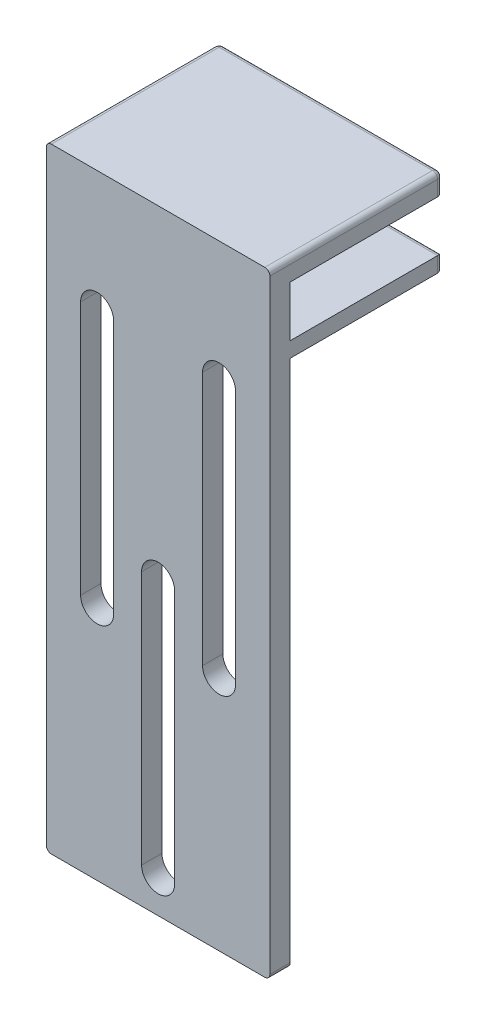
ISO-10303-21;
HEADER;
FILE_DESCRIPTION(('STEP AP214'),'2;1');
FILE_NAME('part.step','',(''),(''),'','','');
FILE_SCHEMA(('AUTOMOTIVE_DESIGN { 1 0 10303 214 1 1 1 1 }'));
ENDSEC;
DATA;
#1=APPLICATION_CONTEXT('core data for automotive mechanical design processes');
#2=APPLICATION_PROTOCOL_DEFINITION('international standard','automotive_design',2000,#1);
#3=PRODUCT_CONTEXT('',#1,'mechanical');
#4=PRODUCT('Part','Part','',(#3));
#5=PRODUCT_RELATED_PRODUCT_CATEGORY('part','',(#4));
#6=PRODUCT_DEFINITION_FORMATION('','',#4);
#7=PRODUCT_DEFINITION_CONTEXT('part definition',#1,'design');
#8=PRODUCT_DEFINITION('design','',#6,#7);
#9=PRODUCT_DEFINITION_SHAPE('','',#8);
#10=(LENGTH_UNIT() NAMED_UNIT(*) SI_UNIT(.MILLI.,.METRE.));
#11=(NAMED_UNIT(*) PLANE_ANGLE_UNIT() SI_UNIT($,.RADIAN.));
#12=(NAMED_UNIT(*) SI_UNIT($,.STERADIAN.) SOLID_ANGLE_UNIT());
#13=UNCERTAINTY_MEASURE_WITH_UNIT(LENGTH_MEASURE(1.E-05),#10,'distance_accuracy_value','');
#14=(GEOMETRIC_REPRESENTATION_CONTEXT(3) GLOBAL_UNCERTAINTY_ASSIGNED_CONTEXT((#13)) GLOBAL_UNIT_ASSIGNED_CONTEXT((#10,
#11,#12)) REPRESENTATION_CONTEXT('',''));
#15=CARTESIAN_POINT('',(0.,0.,0.));
#16=DIRECTION('',(0.,0.,1.));
#17=DIRECTION('',(1.,0.,0.));
#18=AXIS2_PLACEMENT_3D('',#15,#16,#17);
#19=CARTESIAN_POINT('',(0.,0.,0.));
#20=DIRECTION('',(0.,0.,1.));
#21=DIRECTION('',(1.,0.,0.));
#22=AXIS2_PLACEMENT_3D('',#19,#20,#21);
#23=PLANE('',#22);
#24=DIRECTION('',(0.,-1.,0.));
#25=VECTOR('',#24,1.);
#26=CARTESIAN_POINT('',(-22.,0.,0.));
#27=LINE('',#26,#25);
#28=CARTESIAN_POINT('',(-22.,117.,0.));
#29=VERTEX_POINT('',#28);
#30=CARTESIAN_POINT('',(-22.,107.,0.));
#31=VERTEX_POINT('',#30);
#32=EDGE_CURVE('E252',#29,#31,#27,.T.);
#33=ORIENTED_EDGE('',*,*,#32,.F.);
#34=DIRECTION('',(1.,0.,0.));
#35=VECTOR('',#34,1.);
#36=CARTESIAN_POINT('',(0.,117.,0.));
#37=LINE('',#36,#35);
#38=CARTESIAN_POINT('',(22.,117.,0.));
#39=VERTEX_POINT('',#38);
#40=EDGE_CURVE('E239',#29,#39,#37,.T.);
#41=ORIENTED_EDGE('',*,*,#40,.T.);
#42=DIRECTION('',(0.,1.,0.));
#43=VECTOR('',#42,1.);
#44=CARTESIAN_POINT('',(22.,0.,0.));
#45=LINE('',#44,#43);
#46=CARTESIAN_POINT('',(22.,107.,0.));
#47=VERTEX_POINT('',#46);
#48=EDGE_CURVE('E249',#47,#39,#45,.T.);
#49=ORIENTED_EDGE('',*,*,#48,.F.);
#50=DIRECTION('',(1.,0.,0.));
#51=VECTOR('',#50,1.);
#52=CARTESIAN_POINT('',(0.,107.,0.));
#53=LINE('',#52,#51);
#54=EDGE_CURVE('E445',#31,#47,#53,.T.);
#55=ORIENTED_EDGE('',*,*,#54,.F.);
#56=EDGE_LOOP('',(#33,#41,#49,#55));
#57=FACE_BOUND('',#56,.T.);
#58=ADVANCED_FACE('F39',(#57),#23,.F.);
#59=CARTESIAN_POINT('',(15.25,0.,4.));
#60=DIRECTION('',(1.,0.,0.));
#61=DIRECTION('',(0.,1.,0.));
#62=AXIS2_PLACEMENT_3D('',#59,#60,#61);
#63=PLANE('',#62);
#64=DIRECTION('',(0.,-1.,0.));
#65=VECTOR('',#64,1.);
#66=CARTESIAN_POINT('',(15.25,0.,0.));
#67=LINE('',#66,#65);
#68=CARTESIAN_POINT('',(15.25,97.,0.));
#69=VERTEX_POINT('',#68);
#70=CARTESIAN_POINT('',(15.25,47.,0.));
#71=VERTEX_POINT('',#70);
#72=EDGE_CURVE('E297',#69,#71,#67,.T.);
#73=ORIENTED_EDGE('',*,*,#72,.T.);
#74=DIRECTION('',(0.,0.,-1.));
#75=VECTOR('',#74,1.);
#76=CARTESIAN_POINT('',(15.25,47.,4.));
#77=LINE('',#76,#75);
#78=CARTESIAN_POINT('',(15.25,47.,4.));
#79=VERTEX_POINT('',#78);
#80=EDGE_CURVE('E317',#79,#71,#77,.T.);
#81=ORIENTED_EDGE('',*,*,#80,.F.);
#82=DIRECTION('',(0.,-1.,0.));
#83=VECTOR('',#82,1.);
#84=CARTESIAN_POINT('',(15.25,0.,4.));
#85=LINE('',#84,#83);
#86=CARTESIAN_POINT('',(15.25,97.,4.));
#87=VERTEX_POINT('',#86);
#88=EDGE_CURVE('E487',#87,#79,#85,.T.);
#89=ORIENTED_EDGE('',*,*,#88,.F.);
#90=DIRECTION('',(0.,0.,-1.));
#91=VECTOR('',#90,1.);
#92=CARTESIAN_POINT('',(15.25,97.,4.));
#93=LINE('',#92,#91);
#94=EDGE_CURVE('E309',#87,#69,#93,.T.);
#95=ORIENTED_EDGE('',*,*,#94,.T.);
#96=EDGE_LOOP('',(#73,#81,#89,#95));
#97=FACE_BOUND('',#96,.T.);
#98=ADVANCED_FACE('F506',(#97),#63,.F.);
#99=CARTESIAN_POINT('',(12.,47.,4.));
#100=DIRECTION('',(0.,0.,-1.));
#101=DIRECTION('',(-1.,0.,0.));
#102=AXIS2_PLACEMENT_3D('',#99,#100,#101);
#103=CYLINDRICAL_SURFACE('',#102,3.25);
#104=CARTESIAN_POINT('',(12.,47.,0.));
#105=DIRECTION('',(0.,0.,1.));
#106=DIRECTION('',(1.,0.,0.));
#107=AXIS2_PLACEMENT_3D('',#104,#105,#106);
#108=CIRCLE('',#107,3.25);
#109=CARTESIAN_POINT('',(8.75,47.,0.));
#110=VERTEX_POINT('',#109);
#111=EDGE_CURVE('E300',#71,#110,#108,.F.);
#112=ORIENTED_EDGE('',*,*,#111,.T.);
#113=DIRECTION('',(0.,0.,-1.));
#114=VECTOR('',#113,1.);
#115=CARTESIAN_POINT('',(8.75,47.,4.));
#116=LINE('',#115,#114);
#117=CARTESIAN_POINT('',(8.75,47.,4.));
#118=VERTEX_POINT('',#117);
#119=EDGE_CURVE('E315',#118,#110,#116,.T.);
#120=ORIENTED_EDGE('',*,*,#119,.F.);
#121=CARTESIAN_POINT('',(12.,47.,4.));
#122=DIRECTION('',(0.,0.,1.));
#123=DIRECTION('',(1.,0.,0.));
#124=AXIS2_PLACEMENT_3D('',#121,#122,#123);
#125=CIRCLE('',#124,3.25);
#126=EDGE_CURVE('E490',#79,#118,#125,.F.);
#127=ORIENTED_EDGE('',*,*,#126,.F.);
#128=ORIENTED_EDGE('',*,*,#80,.T.);
#129=EDGE_LOOP('',(#112,#120,#127,#128));
#130=FACE_BOUND('',#129,.T.);
#131=ADVANCED_FACE('F508',(#130),#103,.F.);
#132=CARTESIAN_POINT('',(8.75,0.,4.));
#133=DIRECTION('',(1.,0.,0.));
#134=DIRECTION('',(0.,0.,-1.));
#135=AXIS2_PLACEMENT_3D('',#132,#133,#134);
#136=PLANE('',#135);
#137=DIRECTION('',(0.,-1.,0.));
#138=VECTOR('',#137,1.);
#139=CARTESIAN_POINT('',(8.75,0.,0.));
#140=LINE('',#139,#138);
#141=CARTESIAN_POINT('',(8.75,97.,0.));
#142=VERTEX_POINT('',#141);
#143=EDGE_CURVE('E303',#142,#110,#140,.T.);
#144=ORIENTED_EDGE('',*,*,#143,.F.);
#145=DIRECTION('',(0.,0.,-1.));
#146=VECTOR('',#145,1.);
#147=CARTESIAN_POINT('',(8.75,97.,4.));
#148=LINE('',#147,#146);
#149=CARTESIAN_POINT('',(8.75,97.,4.));
#150=VERTEX_POINT('',#149);
#151=EDGE_CURVE('E312',#150,#142,#148,.T.);
#152=ORIENTED_EDGE('',*,*,#151,.F.);
#153=DIRECTION('',(0.,-1.,0.));
#154=VECTOR('',#153,1.);
#155=CARTESIAN_POINT('',(8.75,0.,4.));
#156=LINE('',#155,#154);
#157=EDGE_CURVE('E492',#150,#118,#156,.T.);
#158=ORIENTED_EDGE('',*,*,#157,.T.);
#159=ORIENTED_EDGE('',*,*,#119,.T.);
#160=EDGE_LOOP('',(#144,#152,#158,#159));
#161=FACE_BOUND('',#160,.T.);
#162=ADVANCED_FACE('F512',(#161),#136,.T.);
#163=CARTESIAN_POINT('',(0.,57.,4.));
#164=DIRECTION('',(0.,0.,-1.));
#165=DIRECTION('',(-1.,0.,0.));
#166=AXIS2_PLACEMENT_3D('',#163,#164,#165);
#167=CYLINDRICAL_SURFACE('',#166,3.25);
#168=CARTESIAN_POINT('',(0.,57.,0.));
#169=DIRECTION('',(0.,0.,1.));
#170=DIRECTION('',(1.,0.,0.));
#171=AXIS2_PLACEMENT_3D('',#168,#169,#170);
#172=CIRCLE('',#171,3.25);
#173=CARTESIAN_POINT('',(3.25,57.,0.));
#174=VERTEX_POINT('',#173);
#175=CARTESIAN_POINT('',(-3.25,57.,0.));
#176=VERTEX_POINT('',#175);
#177=EDGE_CURVE('E285',#174,#176,#172,.T.);
#178=ORIENTED_EDGE('',*,*,#177,.F.);
#179=DIRECTION('',(0.,0.,-1.));
#180=VECTOR('',#179,1.);
#181=CARTESIAN_POINT('',(3.25,57.,4.));
#182=LINE('',#181,#180);
#183=CARTESIAN_POINT('',(3.25,57.,4.));
#184=VERTEX_POINT('',#183);
#185=EDGE_CURVE('E313',#184,#174,#182,.T.);
#186=ORIENTED_EDGE('',*,*,#185,.F.);
#187=CARTESIAN_POINT('',(0.,57.,4.));
#188=DIRECTION('',(0.,0.,1.));
#189=DIRECTION('',(1.,0.,0.));
#190=AXIS2_PLACEMENT_3D('',#187,#188,#189);
#191=CIRCLE('',#190,3.25);
#192=CARTESIAN_POINT('',(-3.25,57.,4.));
#193=VERTEX_POINT('',#192);
#194=EDGE_CURVE('E476',#184,#193,#191,.T.);
#195=ORIENTED_EDGE('',*,*,#194,.T.);
#196=DIRECTION('',(0.,0.,-1.));
#197=VECTOR('',#196,1.);
#198=CARTESIAN_POINT('',(-3.25,57.,4.));
#199=LINE('',#198,#197);
#200=EDGE_CURVE('E321',#193,#176,#199,.T.);
#201=ORIENTED_EDGE('',*,*,#200,.T.);
#202=EDGE_LOOP('',(#178,#186,#195,#201));
#203=FACE_BOUND('',#202,.T.);
#204=ADVANCED_FACE('F555',(#203),#167,.F.);
#205=CARTESIAN_POINT('',(3.25,0.,4.));
#206=DIRECTION('',(-1.,0.,0.));
#207=DIRECTION('',(0.,0.,1.));
#208=AXIS2_PLACEMENT_3D('',#205,#206,#207);
#209=PLANE('',#208);
#210=DIRECTION('',(0.,1.,0.));
#211=VECTOR('',#210,1.);
#212=CARTESIAN_POINT('',(3.25,0.,0.));
#213=LINE('',#212,#211);
#214=CARTESIAN_POINT('',(3.25,7.,0.));
#215=VERTEX_POINT('',#214);
#216=EDGE_CURVE('E288',#215,#174,#213,.T.);
#217=ORIENTED_EDGE('',*,*,#216,.F.);
#218=DIRECTION('',(0.,0.,-1.));
#219=VECTOR('',#218,1.);
#220=CARTESIAN_POINT('',(3.25,7.,4.));
#221=LINE('',#220,#219);
#222=CARTESIAN_POINT('',(3.25,7.,4.));
#223=VERTEX_POINT('',#222);
#224=EDGE_CURVE('E326',#223,#215,#221,.T.);
#225=ORIENTED_EDGE('',*,*,#224,.F.);
#226=DIRECTION('',(0.,1.,0.));
#227=VECTOR('',#226,1.);
#228=CARTESIAN_POINT('',(3.25,0.,4.));
#229=LINE('',#228,#227);
#230=EDGE_CURVE('E479',#223,#184,#229,.T.);
#231=ORIENTED_EDGE('',*,*,#230,.T.);
#232=ORIENTED_EDGE('',*,*,#185,.T.);
#233=EDGE_LOOP('',(#217,#225,#231,#232));
#234=FACE_BOUND('',#233,.T.);
#235=ADVANCED_FACE('F551',(#234),#209,.T.);
#236=CARTESIAN_POINT('',(0.,7.,4.));
#237=DIRECTION('',(0.,0.,-1.));
#238=DIRECTION('',(-1.,0.,0.));
#239=AXIS2_PLACEMENT_3D('',#236,#237,#238);
#240=CYLINDRICAL_SURFACE('',#239,3.25);
#241=CARTESIAN_POINT('',(0.,7.,0.));
#242=DIRECTION('',(0.,0.,1.));
#243=DIRECTION('',(1.,0.,0.));
#244=AXIS2_PLACEMENT_3D('',#241,#242,#243);
#245=CIRCLE('',#244,3.25);
#246=CARTESIAN_POINT('',(-3.25,7.,0.));
#247=VERTEX_POINT('',#246);
#248=EDGE_CURVE('E291',#247,#215,#245,.T.);
#249=ORIENTED_EDGE('',*,*,#248,.F.);
#250=DIRECTION('',(0.,0.,-1.));
#251=VECTOR('',#250,1.);
#252=CARTESIAN_POINT('',(-3.25,7.,4.));
#253=LINE('',#252,#251);
#254=CARTESIAN_POINT('',(-3.25,7.,4.));
#255=VERTEX_POINT('',#254);
#256=EDGE_CURVE('E323',#255,#247,#253,.T.);
#257=ORIENTED_EDGE('',*,*,#256,.F.);
#258=CARTESIAN_POINT('',(0.,7.,4.));
#259=DIRECTION('',(0.,0.,1.));
#260=DIRECTION('',(1.,0.,0.));
#261=AXIS2_PLACEMENT_3D('',#258,#259,#260);
#262=CIRCLE('',#261,3.25);
#263=EDGE_CURVE('E482',#255,#223,#262,.T.);
#264=ORIENTED_EDGE('',*,*,#263,.T.);
#265=ORIENTED_EDGE('',*,*,#224,.T.);
#266=EDGE_LOOP('',(#249,#257,#264,#265));
#267=FACE_BOUND('',#266,.T.);
#268=ADVANCED_FACE('F547',(#267),#240,.F.);
#269=CARTESIAN_POINT('',(-12.,47.,4.));
#270=DIRECTION('',(0.,0.,-1.));
#271=DIRECTION('',(-1.,0.,0.));
#272=AXIS2_PLACEMENT_3D('',#269,#270,#271);
#273=CYLINDRICAL_SURFACE('',#272,3.25);
#274=CARTESIAN_POINT('',(-12.,47.,0.));
#275=DIRECTION('',(0.,0.,1.));
#276=DIRECTION('',(1.,0.,0.));
#277=AXIS2_PLACEMENT_3D('',#274,#275,#276);
#278=CIRCLE('',#277,3.25);
#279=CARTESIAN_POINT('',(-15.25,47.,0.));
#280=VERTEX_POINT('',#279);
#281=CARTESIAN_POINT('',(-8.75,47.,0.));
#282=VERTEX_POINT('',#281);
#283=EDGE_CURVE('E273',#280,#282,#278,.T.);
#284=ORIENTED_EDGE('',*,*,#283,.F.);
#285=DIRECTION('',(0.,0.,-1.));
#286=VECTOR('',#285,1.);
#287=CARTESIAN_POINT('',(-15.25,47.,4.));
#288=LINE('',#287,#286);
#289=CARTESIAN_POINT('',(-15.25,47.,4.));
#290=VERTEX_POINT('',#289);
#291=EDGE_CURVE('E324',#290,#280,#288,.T.);
#292=ORIENTED_EDGE('',*,*,#291,.F.);
#293=CARTESIAN_POINT('',(-12.,47.,4.));
#294=DIRECTION('',(0.,0.,1.));
#295=DIRECTION('',(1.,0.,0.));
#296=AXIS2_PLACEMENT_3D('',#293,#294,#295);
#297=CIRCLE('',#296,3.25);
#298=CARTESIAN_POINT('',(-8.75,47.,4.));
#299=VERTEX_POINT('',#298);
#300=EDGE_CURVE('E465',#290,#299,#297,.T.);
#301=ORIENTED_EDGE('',*,*,#300,.T.);
#302=DIRECTION('',(0.,0.,-1.));
#303=VECTOR('',#302,1.);
#304=CARTESIAN_POINT('',(-8.75,47.,4.));
#305=LINE('',#304,#303);
#306=EDGE_CURVE('E329',#299,#282,#305,.T.);
#307=ORIENTED_EDGE('',*,*,#306,.T.);
#308=EDGE_LOOP('',(#284,#292,#301,#307));
#309=FACE_BOUND('',#308,.T.);
#310=ADVANCED_FACE('F550',(#309),#273,.F.);
#311=CARTESIAN_POINT('',(-15.25,0.,4.));
#312=DIRECTION('',(1.,0.,0.));
#313=DIRECTION('',(0.,1.,0.));
#314=AXIS2_PLACEMENT_3D('',#311,#312,#313);
#315=PLANE('',#314);
#316=DIRECTION('',(0.,-1.,0.));
#317=VECTOR('',#316,1.);
#318=CARTESIAN_POINT('',(-15.25,0.,0.));
#319=LINE('',#318,#317);
#320=CARTESIAN_POINT('',(-15.25,97.,0.));
#321=VERTEX_POINT('',#320);
#322=EDGE_CURVE('E276',#321,#280,#319,.T.);
#323=ORIENTED_EDGE('',*,*,#322,.F.);
#324=DIRECTION('',(0.,0.,-1.));
#325=VECTOR('',#324,1.);
#326=CARTESIAN_POINT('',(-15.25,97.,4.));
#327=LINE('',#326,#325);
#328=CARTESIAN_POINT('',(-15.25,97.,4.));
#329=VERTEX_POINT('',#328);
#330=EDGE_CURVE('E334',#329,#321,#327,.T.);
#331=ORIENTED_EDGE('',*,*,#330,.F.);
#332=DIRECTION('',(0.,-1.,0.));
#333=VECTOR('',#332,1.);
#334=CARTESIAN_POINT('',(-15.25,0.,4.));
#335=LINE('',#334,#333);
#336=EDGE_CURVE('E468',#329,#290,#335,.T.);
#337=ORIENTED_EDGE('',*,*,#336,.T.);
#338=ORIENTED_EDGE('',*,*,#291,.T.);
#339=EDGE_LOOP('',(#323,#331,#337,#338));
#340=FACE_BOUND('',#339,.T.);
#341=ADVANCED_FACE('F568',(#340),#315,.T.);
#342=CARTESIAN_POINT('',(-12.,97.,4.));
#343=DIRECTION('',(0.,0.,-1.));
#344=DIRECTION('',(-1.,0.,0.));
#345=AXIS2_PLACEMENT_3D('',#342,#343,#344);
#346=CYLINDRICAL_SURFACE('',#345,3.25);
#347=CARTESIAN_POINT('',(-12.,97.,0.));
#348=DIRECTION('',(0.,0.,1.));
#349=DIRECTION('',(1.,0.,0.));
#350=AXIS2_PLACEMENT_3D('',#347,#348,#349);
#351=CIRCLE('',#350,3.25);
#352=CARTESIAN_POINT('',(-8.75,97.,0.));
#353=VERTEX_POINT('',#352);
#354=EDGE_CURVE('E279',#353,#321,#351,.T.);
#355=ORIENTED_EDGE('',*,*,#354,.F.);
#356=DIRECTION('',(0.,0.,-1.));
#357=VECTOR('',#356,1.);
#358=CARTESIAN_POINT('',(-8.75,97.,4.));
#359=LINE('',#358,#357);
#360=CARTESIAN_POINT('',(-8.75,97.,4.));
#361=VERTEX_POINT('',#360);
#362=EDGE_CURVE('E331',#361,#353,#359,.T.);
#363=ORIENTED_EDGE('',*,*,#362,.F.);
#364=CARTESIAN_POINT('',(-12.,97.,4.));
#365=DIRECTION('',(0.,0.,1.));
#366=DIRECTION('',(1.,0.,0.));
#367=AXIS2_PLACEMENT_3D('',#364,#365,#366);
#368=CIRCLE('',#367,3.25);
#369=EDGE_CURVE('E471',#361,#329,#368,.T.);
#370=ORIENTED_EDGE('',*,*,#369,.T.);
#371=ORIENTED_EDGE('',*,*,#330,.T.);
#372=EDGE_LOOP('',(#355,#363,#370,#371));
#373=FACE_BOUND('',#372,.T.);
#374=ADVANCED_FACE('F564',(#373),#346,.F.);
#375=CARTESIAN_POINT('',(21.,1.,4.));
#376=DIRECTION('',(0.,0.,-1.));
#377=DIRECTION('',(-1.,0.,0.));
#378=AXIS2_PLACEMENT_3D('',#375,#376,#377);
#379=CYLINDRICAL_SURFACE('',#378,1.);
#380=CARTESIAN_POINT('',(21.,1.,0.));
#381=DIRECTION('',(0.,0.,1.));
#382=DIRECTION('',(1.,0.,0.));
#383=AXIS2_PLACEMENT_3D('',#380,#381,#382);
#384=CIRCLE('',#383,1.);
#385=CARTESIAN_POINT('',(22.,1.00000000000001,0.));
#386=VERTEX_POINT('',#385);
#387=CARTESIAN_POINT('',(21.,0.,0.));
#388=VERTEX_POINT('',#387);
#389=EDGE_CURVE('E258',#386,#388,#384,.F.);
#390=ORIENTED_EDGE('',*,*,#389,.F.);
#391=DIRECTION('',(0.,0.,-1.));
#392=VECTOR('',#391,1.);
#393=CARTESIAN_POINT('',(22.,1.00000000000001,4.));
#394=LINE('',#393,#392);
#395=CARTESIAN_POINT('',(22.,1.00000000000001,4.));
#396=VERTEX_POINT('',#395);
#397=EDGE_CURVE('E332',#396,#386,#394,.T.);
#398=ORIENTED_EDGE('',*,*,#397,.F.);
#399=CARTESIAN_POINT('',(21.,1.,4.));
#400=DIRECTION('',(0.,0.,1.));
#401=DIRECTION('',(1.,0.,0.));
#402=AXIS2_PLACEMENT_3D('',#399,#400,#401);
#403=CIRCLE('',#402,1.);
#404=CARTESIAN_POINT('',(21.,0.,4.));
#405=VERTEX_POINT('',#404);
#406=EDGE_CURVE('E308',#396,#405,#403,.F.);
#407=ORIENTED_EDGE('',*,*,#406,.T.);
#408=DIRECTION('',(0.,0.,-1.));
#409=VECTOR('',#408,1.);
#410=CARTESIAN_POINT('',(21.,0.,4.));
#411=LINE('',#410,#409);
#412=EDGE_CURVE('E337',#405,#388,#411,.T.);
#413=ORIENTED_EDGE('',*,*,#412,.T.);
#414=EDGE_LOOP('',(#390,#398,#407,#413));
#415=FACE_BOUND('',#414,.T.);
#416=ADVANCED_FACE('F567',(#415),#379,.T.);
#417=CARTESIAN_POINT('',(22.,0.,4.));
#418=DIRECTION('',(-1.,0.,0.));
#419=DIRECTION('',(0.,-1.,0.));
#420=AXIS2_PLACEMENT_3D('',#417,#418,#419);
#421=PLANE('',#420);
#422=DIRECTION('',(0.,0.,1.));
#423=VECTOR('',#422,1.);
#424=CARTESIAN_POINT('',(22.,117.,-30.));
#425=LINE('',#424,#423);
#426=CARTESIAN_POINT('',(22.,117.,-29.));
#427=VERTEX_POINT('',#426);
#428=EDGE_CURVE('E236',#427,#39,#425,.T.);
#429=ORIENTED_EDGE('',*,*,#428,.F.);
#430=DIRECTION('',(0.,1.,0.));
#431=VECTOR('',#430,1.);
#432=CARTESIAN_POINT('',(22.,0.,-29.));
#433=LINE('',#432,#431);
#434=CARTESIAN_POINT('',(22.,120.,-29.));
#435=VERTEX_POINT('',#434);
#436=EDGE_CURVE('E11',#427,#435,#433,.T.);
#437=ORIENTED_EDGE('',*,*,#436,.T.);
#438=DIRECTION('',(0.,0.,-1.));
#439=VECTOR('',#438,1.);
#440=CARTESIAN_POINT('',(22.,120.,4.));
#441=LINE('',#440,#439);
#442=CARTESIAN_POINT('',(22.,120.,4.));
#443=VERTEX_POINT('',#442);
#444=EDGE_CURVE('E355',#443,#435,#441,.T.);
#445=ORIENTED_EDGE('',*,*,#444,.F.);
#446=DIRECTION('',(0.,1.,0.));
#447=VECTOR('',#446,1.);
#448=CARTESIAN_POINT('',(22.,0.,4.));
#449=LINE('',#448,#447);
#450=EDGE_CURVE('E451',#396,#443,#449,.T.);
#451=ORIENTED_EDGE('',*,*,#450,.F.);
#452=ORIENTED_EDGE('',*,*,#397,.T.);
#453=CARTESIAN_POINT('',(22.,104.,0.));
#454=VERTEX_POINT('',#453);
#455=EDGE_CURVE('E257',#386,#454,#45,.T.);
#456=ORIENTED_EDGE('',*,*,#455,.T.);
#457=DIRECTION('',(0.,0.,1.));
#458=VECTOR('',#457,1.);
#459=CARTESIAN_POINT('',(22.,104.,-30.));
#460=LINE('',#459,#458);
#461=CARTESIAN_POINT('',(22.,104.,-29.));
#462=VERTEX_POINT('',#461);
#463=EDGE_CURVE('E439',#462,#454,#460,.T.);
#464=ORIENTED_EDGE('',*,*,#463,.F.);
#465=DIRECTION('',(0.,1.,0.));
#466=VECTOR('',#465,1.);
#467=CARTESIAN_POINT('',(22.,0.,-29.));
#468=LINE('',#467,#466);
#469=CARTESIAN_POINT('',(22.,107.,-29.));
#470=VERTEX_POINT('',#469);
#471=EDGE_CURVE('E48',#462,#470,#468,.T.);
#472=ORIENTED_EDGE('',*,*,#471,.T.);
#473=DIRECTION('',(0.,0.,1.));
#474=VECTOR('',#473,1.);
#475=CARTESIAN_POINT('',(22.,107.,-30.));
#476=LINE('',#475,#474);
#477=EDGE_CURVE('E256',#470,#47,#476,.T.);
#478=ORIENTED_EDGE('',*,*,#477,.T.);
#479=ORIENTED_EDGE('',*,*,#48,.T.);
#480=EDGE_LOOP('',(#429,#437,#445,#451,#452,#456,#464,#472,#478,#479));
#481=FACE_BOUND('',#480,.T.);
#482=ADVANCED_FACE('F255',(#481),#421,.F.);
#483=CARTESIAN_POINT('',(21.,120.,4.));
#484=DIRECTION('',(0.,0.,-1.));
#485=DIRECTION('',(-1.,0.,0.));
#486=AXIS2_PLACEMENT_3D('',#483,#484,#485);
#487=CYLINDRICAL_SURFACE('',#486,1.);
#488=ORIENTED_EDGE('',*,*,#444,.T.);
#489=CARTESIAN_POINT('',(21.,120.,-29.));
#490=DIRECTION('',(0.,0.,-1.));
#491=DIRECTION('',(-1.,0.,0.));
#492=AXIS2_PLACEMENT_3D('',#489,#490,#491);
#493=CIRCLE('',#492,1.);
#494=CARTESIAN_POINT('',(21.,121.,-29.));
#495=VERTEX_POINT('',#494);
#496=EDGE_CURVE('E376',#435,#495,#493,.F.);
#497=ORIENTED_EDGE('',*,*,#496,.T.);
#498=DIRECTION('',(0.,0.,-1.));
#499=VECTOR('',#498,1.);
#500=CARTESIAN_POINT('',(21.,121.,4.));
#501=LINE('',#500,#499);
#502=CARTESIAN_POINT('',(21.,121.,4.));
#503=VERTEX_POINT('',#502);
#504=EDGE_CURVE('E352',#503,#495,#501,.T.);
#505=ORIENTED_EDGE('',*,*,#504,.F.);
#506=CARTESIAN_POINT('',(21.,120.,4.));
#507=DIRECTION('',(0.,0.,1.));
#508=DIRECTION('',(1.,0.,0.));
#509=AXIS2_PLACEMENT_3D('',#506,#507,#508);
#510=CIRCLE('',#509,1.);
#511=EDGE_CURVE('E453',#443,#503,#510,.T.);
#512=ORIENTED_EDGE('',*,*,#511,.F.);
#513=EDGE_LOOP('',(#488,#497,#505,#512));
#514=FACE_BOUND('',#513,.T.);
#515=ADVANCED_FACE('F593',(#514),#487,.T.);
#516=CARTESIAN_POINT('',(0.,121.,4.));
#517=DIRECTION('',(0.,-1.,0.));
#518=DIRECTION('',(0.,0.,-1.));
#519=AXIS2_PLACEMENT_3D('',#516,#517,#518);
#520=PLANE('',#519);
#521=ORIENTED_EDGE('',*,*,#504,.T.);
#522=DIRECTION('',(-1.,0.,0.));
#523=VECTOR('',#522,1.);
#524=CARTESIAN_POINT('',(0.,121.,-29.));
#525=LINE('',#524,#523);
#526=CARTESIAN_POINT('',(-21.,121.,-29.));
#527=VERTEX_POINT('',#526);
#528=EDGE_CURVE('E374',#495,#527,#525,.T.);
#529=ORIENTED_EDGE('',*,*,#528,.T.);
#530=DIRECTION('',(0.,0.,-1.));
#531=VECTOR('',#530,1.);
#532=CARTESIAN_POINT('',(-21.,121.,4.));
#533=LINE('',#532,#531);
#534=CARTESIAN_POINT('',(-21.,121.,4.));
#535=VERTEX_POINT('',#534);
#536=EDGE_CURVE('E349',#535,#527,#533,.T.);
#537=ORIENTED_EDGE('',*,*,#536,.F.);
#538=DIRECTION('',(-1.,0.,0.));
#539=VECTOR('',#538,1.);
#540=CARTESIAN_POINT('',(0.,121.,4.));
#541=LINE('',#540,#539);
#542=EDGE_CURVE('E455',#503,#535,#541,.T.);
#543=ORIENTED_EDGE('',*,*,#542,.F.);
#544=EDGE_LOOP('',(#521,#529,#537,#543));
#545=FACE_BOUND('',#544,.T.);
#546=ADVANCED_FACE('F589',(#545),#520,.F.);
#547=CARTESIAN_POINT('',(-21.,120.,4.));
#548=DIRECTION('',(0.,0.,-1.));
#549=DIRECTION('',(-1.,0.,0.));
#550=AXIS2_PLACEMENT_3D('',#547,#548,#549);
#551=CYLINDRICAL_SURFACE('',#550,1.);
#552=ORIENTED_EDGE('',*,*,#536,.T.);
#553=CARTESIAN_POINT('',(-21.,120.,-29.));
#554=DIRECTION('',(0.,0.,-1.));
#555=DIRECTION('',(-1.,0.,0.));
#556=AXIS2_PLACEMENT_3D('',#553,#554,#555);
#557=CIRCLE('',#556,1.);
#558=CARTESIAN_POINT('',(-22.,120.,-29.));
#559=VERTEX_POINT('',#558);
#560=EDGE_CURVE('E372',#527,#559,#557,.F.);
#561=ORIENTED_EDGE('',*,*,#560,.T.);
#562=DIRECTION('',(0.,0.,-1.));
#563=VECTOR('',#562,1.);
#564=CARTESIAN_POINT('',(-22.,120.,4.));
#565=LINE('',#564,#563);
#566=CARTESIAN_POINT('',(-22.,120.,4.));
#567=VERTEX_POINT('',#566);
#568=EDGE_CURVE('E346',#567,#559,#565,.T.);
#569=ORIENTED_EDGE('',*,*,#568,.F.);
#570=CARTESIAN_POINT('',(-21.,120.,4.));
#571=DIRECTION('',(0.,0.,1.));
#572=DIRECTION('',(1.,0.,0.));
#573=AXIS2_PLACEMENT_3D('',#570,#571,#572);
#574=CIRCLE('',#573,1.);
#575=EDGE_CURVE('E457',#535,#567,#574,.T.);
#576=ORIENTED_EDGE('',*,*,#575,.F.);
#577=EDGE_LOOP('',(#552,#561,#569,#576));
#578=FACE_BOUND('',#577,.T.);
#579=ADVANCED_FACE('F585',(#578),#551,.T.);
#580=CARTESIAN_POINT('',(-22.,0.,4.));
#581=DIRECTION('',(1.,0.,0.));
#582=DIRECTION('',(0.,1.,0.));
#583=AXIS2_PLACEMENT_3D('',#580,#581,#582);
#584=PLANE('',#583);
#585=ORIENTED_EDGE('',*,*,#568,.T.);
#586=DIRECTION('',(0.,-1.,0.));
#587=VECTOR('',#586,1.);
#588=CARTESIAN_POINT('',(-22.,0.,-29.));
#589=LINE('',#588,#587);
#590=CARTESIAN_POINT('',(-22.,117.,-29.));
#591=VERTEX_POINT('',#590);
#592=EDGE_CURVE('E360',#559,#591,#589,.T.);
#593=ORIENTED_EDGE('',*,*,#592,.T.);
#594=DIRECTION('',(0.,0.,1.));
#595=VECTOR('',#594,1.);
#596=CARTESIAN_POINT('',(-22.,117.,-30.));
#597=LINE('',#596,#595);
#598=EDGE_CURVE('E244',#591,#29,#597,.T.);
#599=ORIENTED_EDGE('',*,*,#598,.T.);
#600=ORIENTED_EDGE('',*,*,#32,.T.);
#601=DIRECTION('',(0.,0.,1.));
#602=VECTOR('',#601,1.);
#603=CARTESIAN_POINT('',(-22.,107.,-30.));
#604=LINE('',#603,#602);
#605=CARTESIAN_POINT('',(-22.,107.,-29.));
#606=VERTEX_POINT('',#605);
#607=EDGE_CURVE('E263',#606,#31,#604,.T.);
#608=ORIENTED_EDGE('',*,*,#607,.F.);
#609=DIRECTION('',(0.,-1.,0.));
#610=VECTOR('',#609,1.);
#611=CARTESIAN_POINT('',(-22.,0.,-29.));
#612=LINE('',#611,#610);
#613=CARTESIAN_POINT('',(-22.,104.,-29.));
#614=VERTEX_POINT('',#613);
#615=EDGE_CURVE('E320',#606,#614,#612,.T.);
#616=ORIENTED_EDGE('',*,*,#615,.T.);
#617=DIRECTION('',(0.,0.,1.));
#618=VECTOR('',#617,1.);
#619=CARTESIAN_POINT('',(-22.,104.,-30.));
#620=LINE('',#619,#618);
#621=CARTESIAN_POINT('',(-22.,104.,0.));
#622=VERTEX_POINT('',#621);
#623=EDGE_CURVE('E441',#614,#622,#620,.T.);
#624=ORIENTED_EDGE('',*,*,#623,.T.);
#625=CARTESIAN_POINT('',(-22.,1.00000000000001,0.));
#626=VERTEX_POINT('',#625);
#627=EDGE_CURVE('E261',#622,#626,#27,.T.);
#628=ORIENTED_EDGE('',*,*,#627,.T.);
#629=DIRECTION('',(0.,0.,-1.));
#630=VECTOR('',#629,1.);
#631=CARTESIAN_POINT('',(-22.,1.00000000000001,4.));
#632=LINE('',#631,#630);
#633=CARTESIAN_POINT('',(-22.,1.00000000000001,4.));
#634=VERTEX_POINT('',#633);
#635=EDGE_CURVE('E343',#634,#626,#632,.T.);
#636=ORIENTED_EDGE('',*,*,#635,.F.);
#637=DIRECTION('',(0.,-1.,0.));
#638=VECTOR('',#637,1.);
#639=CARTESIAN_POINT('',(-22.,0.,4.));
#640=LINE('',#639,#638);
#641=EDGE_CURVE('E459',#567,#634,#640,.T.);
#642=ORIENTED_EDGE('',*,*,#641,.F.);
#643=EDGE_LOOP('',(#585,#593,#599,#600,#608,#616,#624,#628,#636,#642));
#644=FACE_BOUND('',#643,.T.);
#645=ADVANCED_FACE('F581',(#644),#584,.F.);
#646=CARTESIAN_POINT('',(-21.,1.,4.));
#647=DIRECTION('',(0.,0.,-1.));
#648=DIRECTION('',(-1.,0.,0.));
#649=AXIS2_PLACEMENT_3D('',#646,#647,#648);
#650=CYLINDRICAL_SURFACE('',#649,1.);
#651=CARTESIAN_POINT('',(-21.,1.,0.));
#652=DIRECTION('',(0.,0.,1.));
#653=DIRECTION('',(1.,0.,0.));
#654=AXIS2_PLACEMENT_3D('',#651,#652,#653);
#655=CIRCLE('',#654,1.);
#656=CARTESIAN_POINT('',(-21.,0.,0.));
#657=VERTEX_POINT('',#656);
#658=EDGE_CURVE('E268',#626,#657,#655,.T.);
#659=ORIENTED_EDGE('',*,*,#658,.T.);
#660=DIRECTION('',(0.,0.,-1.));
#661=VECTOR('',#660,1.);
#662=CARTESIAN_POINT('',(-21.,0.,4.));
#663=LINE('',#662,#661);
#664=CARTESIAN_POINT('',(-21.,0.,4.));
#665=VERTEX_POINT('',#664);
#666=EDGE_CURVE('E339',#665,#657,#663,.T.);
#667=ORIENTED_EDGE('',*,*,#666,.F.);
#668=CARTESIAN_POINT('',(-21.,1.,4.));
#669=DIRECTION('',(0.,0.,1.));
#670=DIRECTION('',(1.,0.,0.));
#671=AXIS2_PLACEMENT_3D('',#668,#669,#670);
#672=CIRCLE('',#671,1.);
#673=EDGE_CURVE('E461',#634,#665,#672,.T.);
#674=ORIENTED_EDGE('',*,*,#673,.F.);
#675=ORIENTED_EDGE('',*,*,#635,.T.);
#676=EDGE_LOOP('',(#659,#667,#674,#675));
#677=FACE_BOUND('',#676,.T.);
#678=ADVANCED_FACE('F545',(#677),#650,.T.);
#679=CARTESIAN_POINT('',(-3.25,0.,4.));
#680=DIRECTION('',(-1.,0.,0.));
#681=DIRECTION('',(0.,0.,1.));
#682=AXIS2_PLACEMENT_3D('',#679,#680,#681);
#683=PLANE('',#682);
#684=DIRECTION('',(0.,1.,0.));
#685=VECTOR('',#684,1.);
#686=CARTESIAN_POINT('',(-3.25,0.,0.));
#687=LINE('',#686,#685);
#688=EDGE_CURVE('E294',#247,#176,#687,.T.);
#689=ORIENTED_EDGE('',*,*,#688,.T.);
#690=ORIENTED_EDGE('',*,*,#200,.F.);
#691=DIRECTION('',(0.,1.,0.));
#692=VECTOR('',#691,1.);
#693=CARTESIAN_POINT('',(-3.25,0.,4.));
#694=LINE('',#693,#692);
#695=EDGE_CURVE('E485',#255,#193,#694,.T.);
#696=ORIENTED_EDGE('',*,*,#695,.F.);
#697=ORIENTED_EDGE('',*,*,#256,.T.);
#698=EDGE_LOOP('',(#689,#690,#696,#697));
#699=FACE_BOUND('',#698,.T.);
#700=ADVANCED_FACE('F541',(#699),#683,.F.);
#701=CARTESIAN_POINT('',(-8.75,0.,4.));
#702=DIRECTION('',(1.,0.,0.));
#703=DIRECTION('',(0.,0.,-1.));
#704=AXIS2_PLACEMENT_3D('',#701,#702,#703);
#705=PLANE('',#704);
#706=DIRECTION('',(0.,-1.,0.));
#707=VECTOR('',#706,1.);
#708=CARTESIAN_POINT('',(-8.75,0.,0.));
#709=LINE('',#708,#707);
#710=EDGE_CURVE('E282',#353,#282,#709,.T.);
#711=ORIENTED_EDGE('',*,*,#710,.T.);
#712=ORIENTED_EDGE('',*,*,#306,.F.);
#713=DIRECTION('',(0.,-1.,0.));
#714=VECTOR('',#713,1.);
#715=CARTESIAN_POINT('',(-8.75,0.,4.));
#716=LINE('',#715,#714);
#717=EDGE_CURVE('E474',#361,#299,#716,.T.);
#718=ORIENTED_EDGE('',*,*,#717,.F.);
#719=ORIENTED_EDGE('',*,*,#362,.T.);
#720=EDGE_LOOP('',(#711,#712,#718,#719));
#721=FACE_BOUND('',#720,.T.);
#722=ADVANCED_FACE('F544',(#721),#705,.F.);
#723=CARTESIAN_POINT('',(0.,0.,4.));
#724=DIRECTION('',(0.,1.,0.));
#725=DIRECTION('',(0.,0.,1.));
#726=AXIS2_PLACEMENT_3D('',#723,#724,#725);
#727=PLANE('',#726);
#728=DIRECTION('',(1.,0.,0.));
#729=VECTOR('',#728,1.);
#730=CARTESIAN_POINT('',(0.,0.,0.));
#731=LINE('',#730,#729);
#732=EDGE_CURVE('E270',#657,#388,#731,.T.);
#733=ORIENTED_EDGE('',*,*,#732,.T.);
#734=ORIENTED_EDGE('',*,*,#412,.F.);
#735=DIRECTION('',(1.,0.,0.));
#736=VECTOR('',#735,1.);
#737=CARTESIAN_POINT('',(0.,0.,4.));
#738=LINE('',#737,#736);
#739=EDGE_CURVE('E463',#665,#405,#738,.T.);
#740=ORIENTED_EDGE('',*,*,#739,.F.);
#741=ORIENTED_EDGE('',*,*,#666,.T.);
#742=EDGE_LOOP('',(#733,#734,#740,#741));
#743=FACE_BOUND('',#742,.T.);
#744=ADVANCED_FACE('F562',(#743),#727,.F.);
#745=CARTESIAN_POINT('',(12.,97.,4.));
#746=DIRECTION('',(0.,0.,-1.));
#747=DIRECTION('',(-1.,0.,0.));
#748=AXIS2_PLACEMENT_3D('',#745,#746,#747);
#749=CYLINDRICAL_SURFACE('',#748,3.25);
#750=CARTESIAN_POINT('',(12.,97.,0.));
#751=DIRECTION('',(0.,0.,1.));
#752=DIRECTION('',(1.,0.,0.));
#753=AXIS2_PLACEMENT_3D('',#750,#751,#752);
#754=CIRCLE('',#753,3.25);
#755=EDGE_CURVE('E306',#142,#69,#754,.F.);
#756=ORIENTED_EDGE('',*,*,#755,.T.);
#757=ORIENTED_EDGE('',*,*,#94,.F.);
#758=CARTESIAN_POINT('',(12.,97.,4.));
#759=DIRECTION('',(0.,0.,1.));
#760=DIRECTION('',(1.,0.,0.));
#761=AXIS2_PLACEMENT_3D('',#758,#759,#760);
#762=CIRCLE('',#761,3.25);
#763=EDGE_CURVE('E340',#150,#87,#762,.F.);
#764=ORIENTED_EDGE('',*,*,#763,.F.);
#765=ORIENTED_EDGE('',*,*,#151,.T.);
#766=EDGE_LOOP('',(#756,#757,#764,#765));
#767=FACE_BOUND('',#766,.T.);
#768=ADVANCED_FACE('F502',(#767),#749,.F.);
#769=CARTESIAN_POINT('',(0.,0.,4.));
#770=DIRECTION('',(0.,0.,1.));
#771=DIRECTION('',(1.,0.,0.));
#772=AXIS2_PLACEMENT_3D('',#769,#770,#771);
#773=PLANE('',#772);
#774=ORIENTED_EDGE('',*,*,#406,.F.);
#775=ORIENTED_EDGE('',*,*,#450,.T.);
#776=ORIENTED_EDGE('',*,*,#511,.T.);
#777=ORIENTED_EDGE('',*,*,#542,.T.);
#778=ORIENTED_EDGE('',*,*,#575,.T.);
#779=ORIENTED_EDGE('',*,*,#641,.T.);
#780=ORIENTED_EDGE('',*,*,#673,.T.);
#781=ORIENTED_EDGE('',*,*,#739,.T.);
#782=EDGE_LOOP('',(#774,#775,#776,#777,#778,#779,#780,#781));
#783=FACE_BOUND('',#782,.T.);
#784=ORIENTED_EDGE('',*,*,#300,.F.);
#785=ORIENTED_EDGE('',*,*,#336,.F.);
#786=ORIENTED_EDGE('',*,*,#369,.F.);
#787=ORIENTED_EDGE('',*,*,#717,.T.);
#788=EDGE_LOOP('',(#784,#785,#786,#787));
#789=FACE_BOUND('',#788,.T.);
#790=ORIENTED_EDGE('',*,*,#194,.F.);
#791=ORIENTED_EDGE('',*,*,#230,.F.);
#792=ORIENTED_EDGE('',*,*,#263,.F.);
#793=ORIENTED_EDGE('',*,*,#695,.T.);
#794=EDGE_LOOP('',(#790,#791,#792,#793));
#795=FACE_BOUND('',#794,.T.);
#796=ORIENTED_EDGE('',*,*,#88,.T.);
#797=ORIENTED_EDGE('',*,*,#126,.T.);
#798=ORIENTED_EDGE('',*,*,#157,.F.);
#799=ORIENTED_EDGE('',*,*,#763,.T.);
#800=EDGE_LOOP('',(#796,#797,#798,#799));
#801=FACE_BOUND('',#800,.T.);
#802=ADVANCED_FACE('F498',(#783,#789,#795,#801),#773,.T.);
#803=ORIENTED_EDGE('',*,*,#627,.F.);
#804=DIRECTION('',(1.,0.,0.));
#805=VECTOR('',#804,1.);
#806=CARTESIAN_POINT('',(0.,104.,0.));
#807=LINE('',#806,#805);
#808=EDGE_CURVE('E243',#622,#454,#807,.T.);
#809=ORIENTED_EDGE('',*,*,#808,.T.);
#810=ORIENTED_EDGE('',*,*,#455,.F.);
#811=ORIENTED_EDGE('',*,*,#389,.T.);
#812=ORIENTED_EDGE('',*,*,#732,.F.);
#813=ORIENTED_EDGE('',*,*,#658,.F.);
#814=EDGE_LOOP('',(#803,#809,#810,#811,#812,#813));
#815=FACE_BOUND('',#814,.T.);
#816=ORIENTED_EDGE('',*,*,#283,.T.);
#817=ORIENTED_EDGE('',*,*,#710,.F.);
#818=ORIENTED_EDGE('',*,*,#354,.T.);
#819=ORIENTED_EDGE('',*,*,#322,.T.);
#820=EDGE_LOOP('',(#816,#817,#818,#819));
#821=FACE_BOUND('',#820,.T.);
#822=ORIENTED_EDGE('',*,*,#177,.T.);
#823=ORIENTED_EDGE('',*,*,#688,.F.);
#824=ORIENTED_EDGE('',*,*,#248,.T.);
#825=ORIENTED_EDGE('',*,*,#216,.T.);
#826=EDGE_LOOP('',(#822,#823,#824,#825));
#827=FACE_BOUND('',#826,.T.);
#828=ORIENTED_EDGE('',*,*,#72,.F.);
#829=ORIENTED_EDGE('',*,*,#755,.F.);
#830=ORIENTED_EDGE('',*,*,#143,.T.);
#831=ORIENTED_EDGE('',*,*,#111,.F.);
#832=EDGE_LOOP('',(#828,#829,#830,#831));
#833=FACE_BOUND('',#832,.T.);
#834=ADVANCED_FACE('F514',(#815,#821,#827,#833),#23,.F.);
#835=CARTESIAN_POINT('',(0.,107.,-30.));
#836=DIRECTION('',(0.,-1.,0.));
#837=DIRECTION('',(0.,0.,-1.));
#838=AXIS2_PLACEMENT_3D('',#835,#836,#837);
#839=PLANE('',#838);
#840=ORIENTED_EDGE('',*,*,#477,.F.);
#841=DIRECTION('',(1.,0.,0.));
#842=VECTOR('',#841,1.);
#843=CARTESIAN_POINT('',(0.,107.,-29.));
#844=LINE('',#843,#842);
#845=EDGE_CURVE('E390',#470,#606,#844,.F.);
#846=ORIENTED_EDGE('',*,*,#845,.T.);
#847=ORIENTED_EDGE('',*,*,#607,.T.);
#848=ORIENTED_EDGE('',*,*,#54,.T.);
#849=EDGE_LOOP('',(#840,#846,#847,#848));
#850=FACE_BOUND('',#849,.T.);
#851=ADVANCED_FACE('F516',(#850),#839,.F.);
#852=CARTESIAN_POINT('',(0.,104.,-30.));
#853=DIRECTION('',(0.,-1.,0.));
#854=DIRECTION('',(0.,0.,-1.));
#855=AXIS2_PLACEMENT_3D('',#852,#853,#854);
#856=PLANE('',#855);
#857=ORIENTED_EDGE('',*,*,#623,.F.);
#858=DIRECTION('',(1.,0.,0.));
#859=VECTOR('',#858,1.);
#860=CARTESIAN_POINT('',(22.,104.,-29.));
#861=LINE('',#860,#859);
#862=EDGE_CURVE('E378',#614,#462,#861,.T.);
#863=ORIENTED_EDGE('',*,*,#862,.T.);
#864=ORIENTED_EDGE('',*,*,#463,.T.);
#865=ORIENTED_EDGE('',*,*,#808,.F.);
#866=EDGE_LOOP('',(#857,#863,#864,#865));
#867=FACE_BOUND('',#866,.T.);
#868=ADVANCED_FACE('F437',(#867),#856,.T.);
#869=CARTESIAN_POINT('',(0.,0.,-30.));
#870=DIRECTION('',(0.,0.,1.));
#871=DIRECTION('',(1.,0.,0.));
#872=AXIS2_PLACEMENT_3D('',#869,#870,#871);
#873=PLANE('',#872);
#874=DIRECTION('',(1.,0.,0.));
#875=VECTOR('',#874,1.);
#876=CARTESIAN_POINT('',(-22.,105.,-30.));
#877=LINE('',#876,#875);
#878=CARTESIAN_POINT('',(21.,105.,-30.));
#879=VERTEX_POINT('',#878);
#880=CARTESIAN_POINT('',(-21.,105.,-30.));
#881=VERTEX_POINT('',#880);
#882=EDGE_CURVE('E385',#879,#881,#877,.F.);
#883=ORIENTED_EDGE('',*,*,#882,.T.);
#884=DIRECTION('',(0.,-1.,0.));
#885=VECTOR('',#884,1.);
#886=CARTESIAN_POINT('',(-21.,0.,-30.));
#887=LINE('',#886,#885);
#888=CARTESIAN_POINT('',(-21.,106.,-30.));
#889=VERTEX_POINT('',#888);
#890=EDGE_CURVE('E388',#881,#889,#887,.F.);
#891=ORIENTED_EDGE('',*,*,#890,.T.);
#892=DIRECTION('',(1.,0.,0.));
#893=VECTOR('',#892,1.);
#894=CARTESIAN_POINT('',(0.,106.,-30.));
#895=LINE('',#894,#893);
#896=CARTESIAN_POINT('',(21.,106.,-30.));
#897=VERTEX_POINT('',#896);
#898=EDGE_CURVE('E383',#889,#897,#895,.T.);
#899=ORIENTED_EDGE('',*,*,#898,.T.);
#900=DIRECTION('',(0.,1.,0.));
#901=VECTOR('',#900,1.);
#902=CARTESIAN_POINT('',(21.,0.,-30.));
#903=LINE('',#902,#901);
#904=EDGE_CURVE('E381',#897,#879,#903,.F.);
#905=ORIENTED_EDGE('',*,*,#904,.T.);
#906=EDGE_LOOP('',(#883,#891,#899,#905));
#907=FACE_BOUND('',#906,.T.);
#908=ADVANCED_FACE('F428',(#907),#873,.F.);
#909=CARTESIAN_POINT('',(0.,117.,-30.));
#910=DIRECTION('',(0.,-1.,0.));
#911=DIRECTION('',(0.,0.,-1.));
#912=AXIS2_PLACEMENT_3D('',#909,#910,#911);
#913=PLANE('',#912);
#914=ORIENTED_EDGE('',*,*,#598,.F.);
#915=DIRECTION('',(1.,0.,0.));
#916=VECTOR('',#915,1.);
#917=CARTESIAN_POINT('',(22.,117.,-29.));
#918=LINE('',#917,#916);
#919=EDGE_CURVE('E56',#591,#427,#918,.T.);
#920=ORIENTED_EDGE('',*,*,#919,.T.);
#921=ORIENTED_EDGE('',*,*,#428,.T.);
#922=ORIENTED_EDGE('',*,*,#40,.F.);
#923=EDGE_LOOP('',(#914,#920,#921,#922));
#924=FACE_BOUND('',#923,.T.);
#925=ADVANCED_FACE('F238',(#924),#913,.T.);
#926=CARTESIAN_POINT('',(0.,0.,-30.));
#927=DIRECTION('',(0.,0.,1.));
#928=DIRECTION('',(1.,0.,0.));
#929=AXIS2_PLACEMENT_3D('',#926,#927,#928);
#930=PLANE('',#929);
#931=DIRECTION('',(1.,0.,0.));
#932=VECTOR('',#931,1.);
#933=CARTESIAN_POINT('',(-22.,118.,-30.));
#934=LINE('',#933,#932);
#935=CARTESIAN_POINT('',(21.,118.,-30.));
#936=VERTEX_POINT('',#935);
#937=CARTESIAN_POINT('',(-21.,118.,-30.));
#938=VERTEX_POINT('',#937);
#939=EDGE_CURVE('E365',#936,#938,#934,.F.);
#940=ORIENTED_EDGE('',*,*,#939,.T.);
#941=DIRECTION('',(0.,-1.,0.));
#942=VECTOR('',#941,1.);
#943=CARTESIAN_POINT('',(-21.,0.,-30.));
#944=LINE('',#943,#942);
#945=CARTESIAN_POINT('',(-21.,120.,-30.));
#946=VERTEX_POINT('',#945);
#947=EDGE_CURVE('E369',#938,#946,#944,.F.);
#948=ORIENTED_EDGE('',*,*,#947,.T.);
#949=DIRECTION('',(-1.,0.,0.));
#950=VECTOR('',#949,1.);
#951=CARTESIAN_POINT('',(0.,120.,-30.));
#952=LINE('',#951,#950);
#953=CARTESIAN_POINT('',(21.,120.,-30.));
#954=VERTEX_POINT('',#953);
#955=EDGE_CURVE('E367',#946,#954,#952,.F.);
#956=ORIENTED_EDGE('',*,*,#955,.T.);
#957=DIRECTION('',(0.,1.,0.));
#958=VECTOR('',#957,1.);
#959=CARTESIAN_POINT('',(21.,0.,-30.));
#960=LINE('',#959,#958);
#961=EDGE_CURVE('E363',#954,#936,#960,.F.);
#962=ORIENTED_EDGE('',*,*,#961,.T.);
#963=EDGE_LOOP('',(#940,#948,#956,#962));
#964=FACE_BOUND('',#963,.T.);
#965=ADVANCED_FACE('F626',(#964),#930,.F.);
#966=CARTESIAN_POINT('',(21.,120.,-29.));
#967=DIRECTION('',(0.,0.,1.));
#968=DIRECTION('',(1.,0.,0.));
#969=AXIS2_PLACEMENT_3D('',#966,#967,#968);
#970=SPHERICAL_SURFACE('',#969,1.);
#971=CARTESIAN_POINT('',(21.,120.,-29.));
#972=DIRECTION('',(0.,-1.,0.));
#973=DIRECTION('',(0.,0.,-1.));
#974=AXIS2_PLACEMENT_3D('',#971,#972,#973);
#975=CIRCLE('',#974,1.);
#976=EDGE_CURVE('E404',#954,#435,#975,.T.);
#977=ORIENTED_EDGE('',*,*,#976,.F.);
#978=CARTESIAN_POINT('',(21.,120.,-29.));
#979=DIRECTION('',(-1.,0.,0.));
#980=DIRECTION('',(0.,-1.,0.));
#981=AXIS2_PLACEMENT_3D('',#978,#979,#980);
#982=CIRCLE('',#981,1.);
#983=EDGE_CURVE('E253',#495,#954,#982,.T.);
#984=ORIENTED_EDGE('',*,*,#983,.F.);
#985=ORIENTED_EDGE('',*,*,#496,.F.);
#986=EDGE_LOOP('',(#977,#984,#985));
#987=FACE_BOUND('',#986,.T.);
#988=ADVANCED_FACE('F622',(#987),#970,.T.);
#989=CARTESIAN_POINT('',(0.,120.,-29.));
#990=DIRECTION('',(-1.,0.,0.));
#991=DIRECTION('',(0.,0.,1.));
#992=AXIS2_PLACEMENT_3D('',#989,#990,#991);
#993=CYLINDRICAL_SURFACE('',#992,1.);
#994=ORIENTED_EDGE('',*,*,#983,.T.);
#995=ORIENTED_EDGE('',*,*,#955,.F.);
#996=CARTESIAN_POINT('',(-21.,120.,-29.));
#997=DIRECTION('',(-1.,0.,0.));
#998=DIRECTION('',(0.,0.,1.));
#999=AXIS2_PLACEMENT_3D('',#996,#997,#998);
#1000=CIRCLE('',#999,1.);
#1001=EDGE_CURVE('E401',#527,#946,#1000,.T.);
#1002=ORIENTED_EDGE('',*,*,#1001,.F.);
#1003=ORIENTED_EDGE('',*,*,#528,.F.);
#1004=EDGE_LOOP('',(#994,#995,#1002,#1003));
#1005=FACE_BOUND('',#1004,.T.);
#1006=ADVANCED_FACE('F618',(#1005),#993,.T.);
#1007=CARTESIAN_POINT('',(21.,0.,-29.));
#1008=DIRECTION('',(0.,1.,0.));
#1009=DIRECTION('',(-1.,0.,0.));
#1010=AXIS2_PLACEMENT_3D('',#1007,#1008,#1009);
#1011=CYLINDRICAL_SURFACE('',#1010,1.);
#1012=ORIENTED_EDGE('',*,*,#976,.T.);
#1013=ORIENTED_EDGE('',*,*,#436,.F.);
#1014=CARTESIAN_POINT('',(21.,118.,-29.));
#1015=DIRECTION('',(0.707106781186548,0.707106781186547,0.));
#1016=DIRECTION('',(-0.707106781186547,0.707106781186548,0.));
#1017=AXIS2_PLACEMENT_3D('',#1014,#1015,#1016);
#1018=ELLIPSE('',#1017,1.41421356237309,1.);
#1019=EDGE_CURVE('E398',#936,#427,#1018,.F.);
#1020=ORIENTED_EDGE('',*,*,#1019,.F.);
#1021=ORIENTED_EDGE('',*,*,#961,.F.);
#1022=EDGE_LOOP('',(#1012,#1013,#1020,#1021));
#1023=FACE_BOUND('',#1022,.T.);
#1024=ADVANCED_FACE('F614',(#1023),#1011,.T.);
#1025=CARTESIAN_POINT('',(-21.,120.,-29.));
#1026=DIRECTION('',(0.,0.,1.));
#1027=DIRECTION('',(1.,0.,0.));
#1028=AXIS2_PLACEMENT_3D('',#1025,#1026,#1027);
#1029=SPHERICAL_SURFACE('',#1028,1.);
#1030=ORIENTED_EDGE('',*,*,#560,.F.);
#1031=ORIENTED_EDGE('',*,*,#1001,.T.);
#1032=CARTESIAN_POINT('',(-21.,120.,-29.));
#1033=DIRECTION('',(0.,-1.,0.));
#1034=DIRECTION('',(0.,0.,-1.));
#1035=AXIS2_PLACEMENT_3D('',#1032,#1033,#1034);
#1036=CIRCLE('',#1035,1.);
#1037=EDGE_CURVE('E396',#559,#946,#1036,.T.);
#1038=ORIENTED_EDGE('',*,*,#1037,.F.);
#1039=EDGE_LOOP('',(#1030,#1031,#1038));
#1040=FACE_BOUND('',#1039,.T.);
#1041=ADVANCED_FACE('F610',(#1040),#1029,.T.);
#1042=CARTESIAN_POINT('',(0.,118.,-29.));
#1043=DIRECTION('',(-1.,0.,0.));
#1044=DIRECTION('',(0.,0.,1.));
#1045=AXIS2_PLACEMENT_3D('',#1042,#1043,#1044);
#1046=CYLINDRICAL_SURFACE('',#1045,1.);
#1047=ORIENTED_EDGE('',*,*,#1019,.T.);
#1048=ORIENTED_EDGE('',*,*,#919,.F.);
#1049=CARTESIAN_POINT('',(-21.,118.,-29.));
#1050=DIRECTION('',(-0.707106781186548,0.707106781186547,0.));
#1051=DIRECTION('',(-0.707106781186547,-0.707106781186548,0.));
#1052=AXIS2_PLACEMENT_3D('',#1049,#1050,#1051);
#1053=ELLIPSE('',#1052,1.41421356237309,1.);
#1054=EDGE_CURVE('E394',#938,#591,#1053,.T.);
#1055=ORIENTED_EDGE('',*,*,#1054,.F.);
#1056=ORIENTED_EDGE('',*,*,#939,.F.);
#1057=EDGE_LOOP('',(#1047,#1048,#1055,#1056));
#1058=FACE_BOUND('',#1057,.T.);
#1059=ADVANCED_FACE('F606',(#1058),#1046,.T.);
#1060=CARTESIAN_POINT('',(-21.,0.,-29.));
#1061=DIRECTION('',(0.,-1.,0.));
#1062=DIRECTION('',(1.,0.,0.));
#1063=AXIS2_PLACEMENT_3D('',#1060,#1061,#1062);
#1064=CYLINDRICAL_SURFACE('',#1063,1.);
#1065=ORIENTED_EDGE('',*,*,#1037,.T.);
#1066=ORIENTED_EDGE('',*,*,#947,.F.);
#1067=ORIENTED_EDGE('',*,*,#1054,.T.);
#1068=ORIENTED_EDGE('',*,*,#592,.F.);
#1069=EDGE_LOOP('',(#1065,#1066,#1067,#1068));
#1070=FACE_BOUND('',#1069,.T.);
#1071=ADVANCED_FACE('F603',(#1070),#1064,.T.);
#1072=CARTESIAN_POINT('',(0.,106.,-29.));
#1073=DIRECTION('',(1.,0.,0.));
#1074=DIRECTION('',(0.,0.,-1.));
#1075=AXIS2_PLACEMENT_3D('',#1072,#1073,#1074);
#1076=CYLINDRICAL_SURFACE('',#1075,1.);
#1077=CARTESIAN_POINT('',(21.,106.,-29.));
#1078=DIRECTION('',(-0.707106781186547,0.707106781186548,0.));
#1079=DIRECTION('',(0.707106781186548,0.707106781186547,0.));
#1080=AXIS2_PLACEMENT_3D('',#1077,#1078,#1079);
#1081=ELLIPSE('',#1080,1.4142135623731,1.);
#1082=EDGE_CURVE('E412',#897,#470,#1081,.F.);
#1083=ORIENTED_EDGE('',*,*,#1082,.F.);
#1084=ORIENTED_EDGE('',*,*,#898,.F.);
#1085=CARTESIAN_POINT('',(-21.,106.,-29.));
#1086=DIRECTION('',(-0.707106781186547,-0.707106781186548,0.));
#1087=DIRECTION('',(0.707106781186548,-0.707106781186547,0.));
#1088=AXIS2_PLACEMENT_3D('',#1085,#1086,#1087);
#1089=ELLIPSE('',#1088,1.4142135623731,1.);
#1090=EDGE_CURVE('E43',#606,#889,#1089,.T.);
#1091=ORIENTED_EDGE('',*,*,#1090,.F.);
#1092=ORIENTED_EDGE('',*,*,#845,.F.);
#1093=EDGE_LOOP('',(#1083,#1084,#1091,#1092));
#1094=FACE_BOUND('',#1093,.T.);
#1095=ADVANCED_FACE('F41',(#1094),#1076,.T.);
#1096=CARTESIAN_POINT('',(-21.,0.,-29.));
#1097=DIRECTION('',(0.,-1.,0.));
#1098=DIRECTION('',(1.,0.,0.));
#1099=AXIS2_PLACEMENT_3D('',#1096,#1097,#1098);
#1100=CYLINDRICAL_SURFACE('',#1099,1.);
#1101=ORIENTED_EDGE('',*,*,#1090,.T.);
#1102=ORIENTED_EDGE('',*,*,#890,.F.);
#1103=CARTESIAN_POINT('',(-21.,105.,-29.));
#1104=DIRECTION('',(0.707106781186548,-0.707106781186547,0.));
#1105=DIRECTION('',(-0.707106781186547,-0.707106781186548,0.));
#1106=AXIS2_PLACEMENT_3D('',#1103,#1104,#1105);
#1107=ELLIPSE('',#1106,1.41421356237309,1.);
#1108=EDGE_CURVE('E411',#614,#881,#1107,.T.);
#1109=ORIENTED_EDGE('',*,*,#1108,.F.);
#1110=ORIENTED_EDGE('',*,*,#615,.F.);
#1111=EDGE_LOOP('',(#1101,#1102,#1109,#1110));
#1112=FACE_BOUND('',#1111,.T.);
#1113=ADVANCED_FACE('F422',(#1112),#1100,.T.);
#1114=CARTESIAN_POINT('',(21.,0.,-29.));
#1115=DIRECTION('',(0.,1.,0.));
#1116=DIRECTION('',(-1.,0.,0.));
#1117=AXIS2_PLACEMENT_3D('',#1114,#1115,#1116);
#1118=CYLINDRICAL_SURFACE('',#1117,1.);
#1119=ORIENTED_EDGE('',*,*,#1082,.T.);
#1120=ORIENTED_EDGE('',*,*,#471,.F.);
#1121=CARTESIAN_POINT('',(21.,105.,-29.));
#1122=DIRECTION('',(0.707106781186548,0.707106781186547,0.));
#1123=DIRECTION('',(-0.707106781186547,0.707106781186548,0.));
#1124=AXIS2_PLACEMENT_3D('',#1121,#1122,#1123);
#1125=ELLIPSE('',#1124,1.41421356237309,1.);
#1126=EDGE_CURVE('E409',#879,#462,#1125,.F.);
#1127=ORIENTED_EDGE('',*,*,#1126,.F.);
#1128=ORIENTED_EDGE('',*,*,#904,.F.);
#1129=EDGE_LOOP('',(#1119,#1120,#1127,#1128));
#1130=FACE_BOUND('',#1129,.T.);
#1131=ADVANCED_FACE('F434',(#1130),#1118,.T.);
#1132=CARTESIAN_POINT('',(0.,105.,-29.));
#1133=DIRECTION('',(-1.,0.,0.));
#1134=DIRECTION('',(0.,0.,1.));
#1135=AXIS2_PLACEMENT_3D('',#1132,#1133,#1134);
#1136=CYLINDRICAL_SURFACE('',#1135,1.);
#1137=ORIENTED_EDGE('',*,*,#1108,.T.);
#1138=ORIENTED_EDGE('',*,*,#882,.F.);
#1139=ORIENTED_EDGE('',*,*,#1126,.T.);
#1140=ORIENTED_EDGE('',*,*,#862,.F.);
#1141=EDGE_LOOP('',(#1137,#1138,#1139,#1140));
#1142=FACE_BOUND('',#1141,.T.);
#1143=ADVANCED_FACE('F432',(#1142),#1136,.T.);
#1144=CLOSED_SHELL('',(#58,#98,#131,#162,#204,#235,#268,#310,#341,#374,#416,#482,#515,#546,#579,
#645,#678,#700,#722,#744,#768,#802,#834,#851,#868,#908,#925,#965,#988,#1006,#1024,#1041,#1059,
#1071,#1095,#1113,#1131,#1143));
#1145=MANIFOLD_SOLID_BREP('B2',#1144);
#1146=ADVANCED_BREP_SHAPE_REPRESENTATION('',(#18,#1145),#14);
#1147=SHAPE_DEFINITION_REPRESENTATION(#9,#1146);
ENDSEC;
END-ISO-10303-21;
